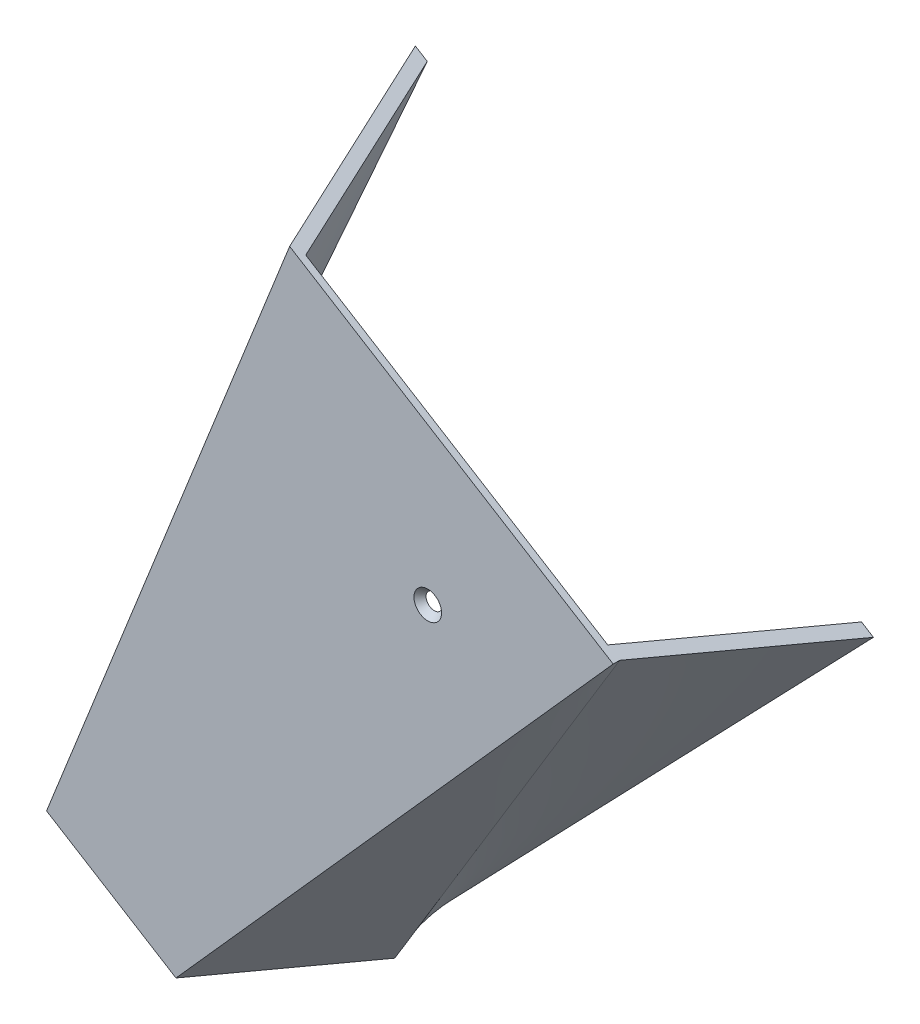
ISO-10303-21;
HEADER;
FILE_DESCRIPTION(('STEP AP214'),'2;1');
FILE_NAME('part.step','',(''),(''),'','','');
FILE_SCHEMA(('AUTOMOTIVE_DESIGN { 1 0 10303 214 1 1 1 1 }'));
ENDSEC;
DATA;
#1=APPLICATION_CONTEXT('core data for automotive mechanical design processes');
#2=APPLICATION_PROTOCOL_DEFINITION('international standard','automotive_design',2000,#1);
#3=PRODUCT_CONTEXT('',#1,'mechanical');
#4=PRODUCT('Part','Part','',(#3));
#5=PRODUCT_RELATED_PRODUCT_CATEGORY('part','',(#4));
#6=PRODUCT_DEFINITION_FORMATION('','',#4);
#7=PRODUCT_DEFINITION_CONTEXT('part definition',#1,'design');
#8=PRODUCT_DEFINITION('design','',#6,#7);
#9=PRODUCT_DEFINITION_SHAPE('','',#8);
#10=(LENGTH_UNIT() NAMED_UNIT(*) SI_UNIT(.MILLI.,.METRE.));
#11=(NAMED_UNIT(*) PLANE_ANGLE_UNIT() SI_UNIT($,.RADIAN.));
#12=(NAMED_UNIT(*) SI_UNIT($,.STERADIAN.) SOLID_ANGLE_UNIT());
#13=UNCERTAINTY_MEASURE_WITH_UNIT(LENGTH_MEASURE(1.E-05),#10,'distance_accuracy_value','');
#14=(GEOMETRIC_REPRESENTATION_CONTEXT(3) GLOBAL_UNCERTAINTY_ASSIGNED_CONTEXT((#13)) GLOBAL_UNIT_ASSIGNED_CONTEXT((#10,
#11,#12)) REPRESENTATION_CONTEXT('',''));
#15=CARTESIAN_POINT('',(0.,0.,0.));
#16=DIRECTION('',(0.,0.,1.));
#17=DIRECTION('',(1.,0.,0.));
#18=AXIS2_PLACEMENT_3D('',#15,#16,#17);
#19=CARTESIAN_POINT('',(149.802871080234,-23.3357740060547,1.));
#20=DIRECTION('',(-0.52566401508533,-0.850692272942672,0.));
#21=DIRECTION('',(0.850692272942672,-0.52566401508533,0.));
#22=AXIS2_PLACEMENT_3D('',#19,#20,#21);
#23=PLANE('',#22);
#24=DIRECTION('',(-0.850692272942672,0.52566401508533,0.));
#25=VECTOR('',#24,1.);
#26=CARTESIAN_POINT('',(149.802871080234,-23.3357740060547,0.));
#27=LINE('',#26,#25);
#28=CARTESIAN_POINT('',(147.96130571807,-22.1978247462492,0.));
#29=VERTEX_POINT('',#28);
#30=CARTESIAN_POINT('',(101.29206816554,6.64026344746749,0.));
#31=VERTEX_POINT('',#30);
#32=EDGE_CURVE('E157',#29,#31,#27,.T.);
#33=ORIENTED_EDGE('',*,*,#32,.T.);
#34=DIRECTION('',(-0.325545838896159,0.201162909563667,-0.923879532511288));
#35=VECTOR('',#34,1.);
#36=CARTESIAN_POINT('',(101.29206816554,6.64026344746748,0.));
#37=LINE('',#36,#35);
#38=CARTESIAN_POINT('',(91.0733881366334,12.9546412121627,-29.));
#39=VERTEX_POINT('',#38);
#40=EDGE_CURVE('E447',#31,#39,#37,.T.);
#41=ORIENTED_EDGE('',*,*,#40,.T.);
#42=DIRECTION('',(-0.850692272942673,0.525664015085329,0.));
#43=VECTOR('',#42,1.);
#44=CARTESIAN_POINT('',(91.0733881366334,12.9546412121627,-29.));
#45=LINE('',#44,#43);
#46=CARTESIAN_POINT('',(89.2318227744691,14.0925904719682,-29.));
#47=VERTEX_POINT('',#46);
#48=EDGE_CURVE('E433',#39,#47,#45,.T.);
#49=ORIENTED_EDGE('',*,*,#48,.T.);
#50=DIRECTION('',(0.32554583889616,-0.201162909563667,0.923879532511288));
#51=VECTOR('',#50,1.);
#52=CARTESIAN_POINT('',(89.2318227744691,14.0925904719682,-29.));
#53=LINE('',#52,#51);
#54=CARTESIAN_POINT('',(99.8028710802345,7.56047554297313,1.));
#55=VERTEX_POINT('',#54);
#56=EDGE_CURVE('E427',#47,#55,#53,.T.);
#57=ORIENTED_EDGE('',*,*,#56,.T.);
#58=DIRECTION('',(-0.850692272942672,0.52566401508533,0.));
#59=VECTOR('',#58,1.);
#60=CARTESIAN_POINT('',(149.802871080234,-23.3357740060547,1.));
#61=LINE('',#60,#59);
#62=CARTESIAN_POINT('',(149.802871080234,-23.3357740060547,1.));
#63=VERTEX_POINT('',#62);
#64=EDGE_CURVE('E156',#63,#55,#61,.T.);
#65=ORIENTED_EDGE('',*,*,#64,.F.);
#66=DIRECTION('',(0.,0.,1.));
#67=VECTOR('',#66,1.);
#68=CARTESIAN_POINT('',(149.802871080234,-23.3357740060547,1.));
#69=LINE('',#68,#67);
#70=CARTESIAN_POINT('',(149.802871080235,-23.3357740060547,0.));
#71=VERTEX_POINT('',#70);
#72=EDGE_CURVE('E106',#63,#71,#69,.F.);
#73=ORIENTED_EDGE('',*,*,#72,.T.);
#74=DIRECTION('',(-0.325545838896166,0.201162909563671,0.923879532511285));
#75=VECTOR('',#74,1.);
#76=CARTESIAN_POINT('',(160.021551109141,-29.6501517707501,-29.));
#77=LINE('',#76,#75);
#78=CARTESIAN_POINT('',(160.021551109141,-29.6501517707501,-29.));
#79=VERTEX_POINT('',#78);
#80=EDGE_CURVE('E282',#79,#71,#77,.T.);
#81=ORIENTED_EDGE('',*,*,#80,.F.);
#82=DIRECTION('',(0.850692272942672,-0.525664015085331,0.));
#83=VECTOR('',#82,1.);
#84=CARTESIAN_POINT('',(158.179985746977,-28.5122025109446,-29.));
#85=LINE('',#84,#83);
#86=CARTESIAN_POINT('',(158.179985746977,-28.5122025109446,-29.));
#87=VERTEX_POINT('',#86);
#88=EDGE_CURVE('E336',#87,#79,#85,.T.);
#89=ORIENTED_EDGE('',*,*,#88,.F.);
#90=DIRECTION('',(0.325545838896165,-0.20116290956367,-0.923879532511285));
#91=VECTOR('',#90,1.);
#92=CARTESIAN_POINT('',(147.608937441211,-21.9800875819494,1.));
#93=LINE('',#92,#91);
#94=EDGE_CURVE('E300',#29,#87,#93,.T.);
#95=ORIENTED_EDGE('',*,*,#94,.F.);
#96=EDGE_LOOP('',(#33,#41,#49,#57,#65,#73,#81,#89,#95));
#97=FACE_BOUND('',#96,.T.);
#98=ADVANCED_FACE('F65',(#97),#23,.F.);
#99=CARTESIAN_POINT('',(99.8028710802344,7.56047554297311,1.));
#100=DIRECTION('',(0.929048944106169,-0.369956834583728,0.));
#101=DIRECTION('',(0.369956834583728,0.929048944106169,0.));
#102=AXIS2_PLACEMENT_3D('',#99,#100,#101);
#103=PLANE('',#102);
#104=DIRECTION('',(-0.369956834583728,-0.929048944106169,0.));
#105=VECTOR('',#104,1.);
#106=CARTESIAN_POINT('',(99.8028710802344,7.56047554297311,1.));
#107=LINE('',#106,#105);
#108=CARTESIAN_POINT('',(62.2364695717015,-86.7776266160025,1.));
#109=VERTEX_POINT('',#108);
#110=EDGE_CURVE('E434',#55,#109,#107,.T.);
#111=ORIENTED_EDGE('',*,*,#110,.F.);
#112=CARTESIAN_POINT('',(99.8028710802345,7.56047554297313,0.999999999999995));
#113=CARTESIAN_POINT('',(97.800730805034,2.53262868424312,0.960822395884246));
#114=CARTESIAN_POINT('',(95.7985853509799,-2.49523117981043,0.923605511379088));
#115=CARTESIAN_POINT('',(91.794285743516,-12.5509727540539,0.852845594113708));
#116=CARTESIAN_POINT('',(89.7921315901069,-17.5788544642416,0.819302560992819));
#117=CARTESIAN_POINT('',(85.6605299173965,-27.9542815754014,0.753619185177171));
#118=CARTESIAN_POINT('',(83.531081910453,-33.3018282009582,0.721703588555466));
#119=CARTESIAN_POINT('',(79.2721788066195,-43.9969392566009,0.661483839307116));
#120=CARTESIAN_POINT('',(77.1427237097292,-49.3445036866878,0.633179686881937));
#121=CARTESIAN_POINT('',(72.8838046720515,-60.0396547559747,0.579939275846278));
#122=CARTESIAN_POINT('',(70.7543407312557,-65.3872413951956,0.555003022144702));
#123=CARTESIAN_POINT('',(66.4954083403662,-76.0824259975495,0.508281573717108));
#124=CARTESIAN_POINT('',(64.3659398902729,-81.4300239606813,0.486496378651858));
#125=CARTESIAN_POINT('',(62.2364695717015,-86.7776266160025,0.466178268526764));
#126=B_SPLINE_CURVE_WITH_KNOTS('',3,(#112,#113,#114,#115,#116,#117,#118,#119,#120,#121,#122,
#123,#124,#125),.UNSPECIFIED.,.F.,.F.,(4,2,2,2,2,2,4),(0.,16.2358886563819,32.4717757188637,
49.7398491256509,67.0079234957484,84.2760230347747,101.544120714778),.UNSPECIFIED.);
#127=CARTESIAN_POINT('',(62.2364695717015,-86.7776266160025,0.466178268526759));
#128=VERTEX_POINT('',#127);
#129=EDGE_CURVE('E410',#55,#128,#126,.T.);
#130=ORIENTED_EDGE('',*,*,#129,.T.);
#131=DIRECTION('',(0.,0.,-1.));
#132=VECTOR('',#131,1.);
#133=CARTESIAN_POINT('',(62.2364695717015,-86.7776266160025,1.));
#134=LINE('',#133,#132);
#135=EDGE_CURVE('E179',#109,#128,#134,.T.);
#136=ORIENTED_EDGE('',*,*,#135,.F.);
#137=EDGE_LOOP('',(#111,#130,#136));
#138=FACE_BOUND('',#137,.T.);
#139=ADVANCED_FACE('F357',(#138),#103,.F.);
#140=CARTESIAN_POINT('',(62.2364695717015,-86.7776266160025,1.));
#141=DIRECTION('',(0.52566401508533,0.850692272942672,0.));
#142=DIRECTION('',(-0.850692272942672,0.52566401508533,0.));
#143=AXIS2_PLACEMENT_3D('',#140,#141,#142);
#144=PLANE('',#143);
#145=ORIENTED_EDGE('',*,*,#135,.T.);
#146=DIRECTION('',(-0.421516202402935,0.260465395567993,-0.868609157690279));
#147=VECTOR('',#146,1.);
#148=CARTESIAN_POINT('',(62.4955210760732,-86.9377010145049,1.));
#149=LINE('',#148,#147);
#150=CARTESIAN_POINT('',(50.3635915807698,-79.4410785905428,-24.));
#151=VERTEX_POINT('',#150);
#152=EDGE_CURVE('E117',#128,#151,#149,.T.);
#153=ORIENTED_EDGE('',*,*,#152,.T.);
#154=DIRECTION('',(0.850692272942669,-0.525664015085336,0.));
#155=VECTOR('',#154,1.);
#156=CARTESIAN_POINT('',(50.3635915807698,-79.4410785905428,-24.));
#157=LINE('',#156,#155);
#158=CARTESIAN_POINT('',(52.3223373881587,-80.6514365759068,-24.));
#159=VERTEX_POINT('',#158);
#160=EDGE_CURVE('E400',#151,#159,#157,.T.);
#161=ORIENTED_EDGE('',*,*,#160,.T.);
#162=DIRECTION('',(0.421516202402931,-0.260465395567989,0.868609157690283));
#163=VECTOR('',#162,1.);
#164=CARTESIAN_POINT('',(52.3223373881587,-80.6514365759068,-24.));
#165=LINE('',#164,#163);
#166=CARTESIAN_POINT('',(58.7374315007476,-84.6154835475677,-10.7805568045206));
#167=VERTEX_POINT('',#166);
#168=EDGE_CURVE('E397',#159,#167,#165,.T.);
#169=ORIENTED_EDGE('',*,*,#168,.T.);
#170=DIRECTION('',(0.421516202402956,-0.260465395568005,0.868609157690266));
#171=VECTOR('',#170,1.);
#172=CARTESIAN_POINT('',(58.7374315007476,-84.6154835475677,-10.7805568045206));
#173=LINE('',#172,#171);
#174=CARTESIAN_POINT('',(63.9689897036503,-87.8481941029106,0.));
#175=VERTEX_POINT('',#174);
#176=EDGE_CURVE('E151',#167,#175,#173,.T.);
#177=ORIENTED_EDGE('',*,*,#176,.T.);
#178=DIRECTION('',(0.850692272942672,-0.52566401508533,0.));
#179=VECTOR('',#178,1.);
#180=CARTESIAN_POINT('',(62.2364695717015,-86.7776266160025,0.));
#181=LINE('',#180,#179);
#182=CARTESIAN_POINT('',(80.7472724863961,-98.215914340108,0.));
#183=VERTEX_POINT('',#182);
#184=EDGE_CURVE('E142',#175,#183,#181,.T.);
#185=ORIENTED_EDGE('',*,*,#184,.T.);
#186=DIRECTION('',(0.32554583889616,-0.201162909563667,-0.923879532511288));
#187=VECTOR('',#186,1.);
#188=CARTESIAN_POINT('',(80.3955101727458,-97.9985516156184,0.998280312819211));
#189=LINE('',#188,#187);
#190=CARTESIAN_POINT('',(89.2041111310084,-103.441606283304,-24.));
#191=VERTEX_POINT('',#190);
#192=EDGE_CURVE('E147',#183,#191,#189,.T.);
#193=ORIENTED_EDGE('',*,*,#192,.T.);
#194=DIRECTION('',(0.850692272942673,-0.525664015085328,0.));
#195=VECTOR('',#194,1.);
#196=CARTESIAN_POINT('',(89.2041111310084,-103.441606283304,-24.));
#197=LINE('',#196,#195);
#198=CARTESIAN_POINT('',(91.0456764931727,-104.57955554311,-24.));
#199=VERTEX_POINT('',#198);
#200=EDGE_CURVE('E168',#191,#199,#197,.T.);
#201=ORIENTED_EDGE('',*,*,#200,.T.);
#202=DIRECTION('',(-0.32554583889616,0.201162909563667,0.923879532511288));
#203=VECTOR('',#202,1.);
#204=CARTESIAN_POINT('',(91.0456764931727,-104.57955554311,-24.));
#205=LINE('',#204,#203);
#206=CARTESIAN_POINT('',(82.2364695717015,-99.1361264356136,1.));
#207=VERTEX_POINT('',#206);
#208=EDGE_CURVE('E307',#199,#207,#205,.T.);
#209=ORIENTED_EDGE('',*,*,#208,.T.);
#210=DIRECTION('',(0.850692272942672,-0.52566401508533,0.));
#211=VECTOR('',#210,1.);
#212=CARTESIAN_POINT('',(62.2364695717015,-86.7776266160025,1.));
#213=LINE('',#212,#211);
#214=EDGE_CURVE('E472',#109,#207,#213,.T.);
#215=ORIENTED_EDGE('',*,*,#214,.F.);
#216=EDGE_LOOP('',(#145,#153,#161,#169,#177,#185,#193,#201,#209,#215));
#217=FACE_BOUND('',#216,.T.);
#218=ADVANCED_FACE('F145',(#217),#144,.F.);
#219=CARTESIAN_POINT('',(0.,0.,1.));
#220=DIRECTION('',(0.,0.,1.));
#221=DIRECTION('',(1.,0.,0.));
#222=AXIS2_PLACEMENT_3D('',#219,#220,#221);
#223=PLANE('',#222);
#224=CARTESIAN_POINT('',(121.150579346114,-29.7579794074423,1.));
#225=DIRECTION('',(0.,0.,1.));
#226=DIRECTION('',(1.,0.,0.));
#227=AXIS2_PLACEMENT_3D('',#224,#225,#226);
#228=CIRCLE('',#227,2.1336);
#229=CARTESIAN_POINT('',(123.284179346114,-29.7579794074423,1.));
#230=VERTEX_POINT('',#229);
#231=EDGE_CURVE('E726',#230,#230,#228,.T.);
#232=ORIENTED_EDGE('',*,*,#231,.F.);
#233=EDGE_LOOP('',(#232));
#234=FACE_BOUND('',#233,.T.);
#235=ORIENTED_EDGE('',*,*,#214,.T.);
#236=DIRECTION('',(0.66539916048739,0.746487747536874,0.));
#237=VECTOR('',#236,1.);
#238=CARTESIAN_POINT('',(82.2364695717015,-99.1361264356136,1.));
#239=LINE('',#238,#237);
#240=EDGE_CURVE('E312',#207,#63,#239,.T.);
#241=ORIENTED_EDGE('',*,*,#240,.T.);
#242=ORIENTED_EDGE('',*,*,#64,.T.);
#243=ORIENTED_EDGE('',*,*,#110,.T.);
#244=EDGE_LOOP('',(#235,#241,#242,#243));
#245=FACE_BOUND('',#244,.T.);
#246=ADVANCED_FACE('F356',(#234,#245),#223,.T.);
#247=CARTESIAN_POINT('',(0.,0.,0.));
#248=DIRECTION('',(0.,0.,1.));
#249=DIRECTION('',(1.,0.,0.));
#250=AXIS2_PLACEMENT_3D('',#247,#248,#249);
#251=PLANE('',#250);
#252=CARTESIAN_POINT('',(121.150579346114,-29.7579794074423,0.));
#253=DIRECTION('',(0.,0.,1.));
#254=DIRECTION('',(1.,0.,0.));
#255=AXIS2_PLACEMENT_3D('',#252,#253,#254);
#256=CIRCLE('',#255,1.26431326218377);
#257=CARTESIAN_POINT('',(122.414892608298,-29.7579794074423,0.));
#258=VERTEX_POINT('',#257);
#259=EDGE_CURVE('E69',#258,#258,#256,.T.);
#260=ORIENTED_EDGE('',*,*,#259,.T.);
#261=EDGE_LOOP('',(#260));
#262=FACE_BOUND('',#261,.T.);
#263=ORIENTED_EDGE('',*,*,#184,.F.);
#264=CARTESIAN_POINT('',(63.9689897036503,-87.8481941029106,0.));
#265=CARTESIAN_POINT('',(65.6086194750051,-83.6351551124729,0.));
#266=CARTESIAN_POINT('',(67.2484328201354,-79.4221874808441,0.));
#267=CARTESIAN_POINT('',(70.5287858793149,-70.9965332574647,0.));
#268=CARTESIAN_POINT('',(72.1693255936286,-66.7838466658172,0.));
#269=CARTESIAN_POINT('',(75.4514894498988,-58.3588958337148,0.));
#270=CARTESIAN_POINT('',(77.0931135918764,-54.1466315932682,0.));
#271=CARTESIAN_POINT('',(80.3781688825248,-45.7228086014839,0.));
#272=CARTESIAN_POINT('',(82.0216000307855,-41.5112498499864,0.));
#273=CARTESIAN_POINT('',(84.4893524719697,-35.1949294805937,0.));
#274=CARTESIAN_POINT('',(85.3123709224591,-33.0896589404609,0.));
#275=CARTESIAN_POINT('',(86.9597074837296,-28.8796254856154,0.));
#276=CARTESIAN_POINT('',(87.7840255949692,-26.7748625710821,0.));
#277=CARTESIAN_POINT('',(89.4346382151987,-22.566108322076,0.));
#278=CARTESIAN_POINT('',(90.2609327266165,-20.4621169885545,0.));
#279=CARTESIAN_POINT('',(91.5028678425473,-17.3071116524831,0.));
#280=CARTESIAN_POINT('',(91.9172617096508,-16.2556069771521,0.));
#281=CARTESIAN_POINT('',(92.7471784845071,-14.1530433633892,0.));
#282=CARTESIAN_POINT('',(93.162701392066,-13.101984424881,0.));
#283=CARTESIAN_POINT('',(93.9953000494071,-11.0004790612977,0.));
#284=CARTESIAN_POINT('',(94.4123758021574,-9.95003263739797,0.));
#285=CARTESIAN_POINT('',(95.2487592351119,-7.85002972264891,0.));
#286=CARTESIAN_POINT('',(95.6680669128099,-6.80047323080186,0.));
#287=CARTESIAN_POINT('',(96.5061667403792,-4.71230883889109,0.));
#288=CARTESIAN_POINT('',(96.9249284128549,-3.67368873346316,0.));
#289=CARTESIAN_POINT('',(97.5570654094205,-2.11737578436286,0.));
#290=CARTESIAN_POINT('',(97.7684442959385,-1.59887237978736,0.));
#291=CARTESIAN_POINT('',(98.1929666617397,-0.562588531000391,0.));
#292=CARTESIAN_POINT('',(98.4061101384246,-0.0448080857257373,0.));
#293=CARTESIAN_POINT('',(98.8348197251901,0.989906302302367,0.));
#294=CARTESIAN_POINT('',(99.0503864463049,1.50683999210468,0.));
#295=CARTESIAN_POINT('',(99.4847936752876,2.53931743426768,0.));
#296=CARTESIAN_POINT('',(99.7036340915436,3.05486122504893,0.));
#297=CARTESIAN_POINT('',(100.0355090532,3.82672178932578,0.));
#298=CARTESIAN_POINT('',(100.146754651827,4.08380744310608,0.));
#299=CARTESIAN_POINT('',(100.370724552992,4.59733171023877,0.));
#300=CARTESIAN_POINT('',(100.483448842657,4.85377032920023,0.));
#301=CARTESIAN_POINT('',(100.710734352953,5.36586056859856,0.));
#302=CARTESIAN_POINT('',(100.825295729835,5.6215121198642,0.));
#303=CARTESIAN_POINT('',(101.056779463549,6.13175231002322,0.));
#304=CARTESIAN_POINT('',(101.173701890939,6.38634091687614,0.));
#305=CARTESIAN_POINT('',(101.29206816554,6.64026344746748,0.));
#306=B_SPLINE_CURVE_WITH_KNOTS('',3,(#264,#265,#266,#267,#268,#269,#270,#271,#272,#273,#274,
#275,#276,#277,#278,#279,#280,#281,#282,#283,#284,#285,#286,#287,#288,#289,#290,#291,#292,#293,
#294,#295,#296,#297,#298,#299,#300,#301,#302,#303,#304,#305),.UNSPECIFIED.,.F.,.F.,(4,2,2,2,2,2,
2,2,2,2,2,2,2,2,2,2,2,2,2,2,4),(0.,13.5625496592338,27.1251042627583,40.6876591332418,
54.2502109270663,61.0314871030628,67.812765672113,74.5940525756081,77.9846949993739,
81.3753368408808,84.7659851666527,88.1566296859162,91.5162076848358,93.1960093803738,
94.8758086030077,96.55604134649,98.2362271575374,99.0765910039275,99.9169475400858,
100.757375935066,101.59782948289),.UNSPECIFIED.);
#307=EDGE_CURVE('E12',#175,#31,#306,.T.);
#308=ORIENTED_EDGE('',*,*,#307,.T.);
#309=ORIENTED_EDGE('',*,*,#32,.F.);
#310=CARTESIAN_POINT('',(147.96130571807,-22.1978247462492,0.));
#311=CARTESIAN_POINT('',(140.791668954574,-30.3066838648569,0.));
#312=CARTESIAN_POINT('',(133.622035574568,-38.4155459750087,0.));
#313=CARTESIAN_POINT('',(119.207749279571,-54.718107634288,0.));
#314=CARTESIAN_POINT('',(111.963096314083,-62.9118071387679,0.));
#315=CARTESIAN_POINT('',(101.096104237844,-75.2023452303936,0.));
#316=CARTESIAN_POINT('',(97.4737714410523,-79.2991894001369,0.));
#317=CARTESIAN_POINT('',(92.040250115751,-85.4444360881807,0.));
#318=CARTESIAN_POINT('',(90.2290726521707,-87.4928483899112,0.));
#319=CARTESIAN_POINT('',(87.5122769885335,-90.5654407881803,0.));
#320=CARTESIAN_POINT('',(86.6066735223356,-91.5896339121925,0.));
#321=CARTESIAN_POINT('',(85.2482370044789,-93.1258959067707,0.));
#322=CARTESIAN_POINT('',(84.7954196117179,-93.6379786234888,0.));
#323=CARTESIAN_POINT('',(84.1161721982735,-94.4060838429654,0.));
#324=CARTESIAN_POINT('',(83.8897528394332,-94.6621157738728,0.));
#325=CARTESIAN_POINT('',(83.4368982754944,-95.1741656225817,0.));
#326=CARTESIAN_POINT('',(83.2104630703959,-95.4301835403832,0.));
#327=CARTESIAN_POINT('',(82.9840155736884,-95.6861905870018,0.));
#328=B_SPLINE_CURVE_WITH_KNOTS('',3,(#310,#311,#312,#313,#314,#315,#316,#317,#318,#319,#320,
#321,#322,#323,#324,#325,#326,#327),.UNSPECIFIED.,.F.,.F.,(4,2,2,2,2,2,2,2,4),(0.,
32.4717660087722,65.2832788273424,81.6890352370311,89.8919134430315,93.9933525485168,
96.0440721047197,97.0694318856136,98.0947916696842),.UNSPECIFIED.);
#329=CARTESIAN_POINT('',(82.9840155736884,-95.6861905870018,0.));
#330=VERTEX_POINT('',#329);
#331=EDGE_CURVE('E175',#29,#330,#328,.T.);
#332=ORIENTED_EDGE('',*,*,#331,.T.);
#333=CARTESIAN_POINT('',(82.9840155736884,-95.6861905870018,0.));
#334=CARTESIAN_POINT('',(82.6115850377633,-96.1081295001179,0.));
#335=CARTESIAN_POINT('',(82.2389745125263,-96.5299092694347,0.));
#336=CARTESIAN_POINT('',(81.4933934834289,-97.3731505204701,0.));
#337=CARTESIAN_POINT('',(81.1204229795684,-97.7946120021886,0.));
#338=CARTESIAN_POINT('',(80.7472724863961,-98.215914340108,0.));
#339=B_SPLINE_CURVE_WITH_KNOTS('',3,(#333,#334,#335,#336,#337,#338),.UNSPECIFIED.,.F.,.F.,(4,2,
4),(0.,1.68838117612731,3.37676235225463),.UNSPECIFIED.);
#340=EDGE_CURVE('E75',#330,#183,#339,.T.);
#341=ORIENTED_EDGE('',*,*,#340,.T.);
#342=EDGE_LOOP('',(#263,#308,#309,#332,#341));
#343=FACE_BOUND('',#342,.T.);
#344=ADVANCED_FACE('F173',(#262,#343),#251,.F.);
#345=CARTESIAN_POINT('',(158.179985746977,-28.5122025109446,-29.));
#346=CARTESIAN_POINT('',(80.3955101727458,-97.9985516156184,0.998280312819211));
#347=CARTESIAN_POINT('',(158.486913307338,-28.7018607209123,-29.));
#348=CARTESIAN_POINT('',(81.8636103324563,-98.905727393566,-3.16809973931728));
#349=CARTESIAN_POINT('',(158.793840867699,-28.8915189308799,-29.));
#350=CARTESIAN_POINT('',(83.3317104921667,-99.8129031715136,-7.33447979145379));
#351=CARTESIAN_POINT('',(159.40769598842,-29.270835350815,-29.));
#352=CARTESIAN_POINT('',(86.2679108115875,-101.627254727409,-15.6672398957269));
#353=CARTESIAN_POINT('',(159.714623548781,-29.4604935607826,-29.));
#354=CARTESIAN_POINT('',(87.736010971298,-102.534430505356,-19.8336199478634));
#355=CARTESIAN_POINT('',(160.021551109141,-29.6501517707501,-29.));
#356=CARTESIAN_POINT('',(89.2041111310084,-103.441606283304,-24.));
#357=B_SPLINE_SURFACE_WITH_KNOTS('',3,1,((#345,#346),(#347,#348),(#349,#350),(#351,#352),(#353,
#354),(#355,#356)),.UNSPECIFIED.,.F.,.F.,.F.,(4,2,4),(2,2),(0.,0.5,1.),(0.,1.),.UNSPECIFIED.);
#358=DIRECTION('',(-0.716712079020224,-0.640252510063002,0.276406438319612));
#359=VECTOR('',#358,1.);
#360=CARTESIAN_POINT('',(119.287747959861,-63.2553770632815,-14.0008598435904));
#361=LINE('',#360,#359);
#362=EDGE_CURVE('E92',#87,#330,#361,.T.);
#363=DIRECTION('',(0.691592109323064,0.720635872916506,-0.0488292226841732));
#364=VECTOR('',#363,1.);
#365=CARTESIAN_POINT('',(124.612831120075,-66.5458790270271,-26.5));
#366=LINE('',#365,#364);
#367=EDGE_CURVE('E166',#191,#79,#366,.T.);
#368=ORIENTED_EDGE('',*,*,#340,.F.);
#369=ORIENTED_EDGE('',*,*,#362,.F.);
#370=ORIENTED_EDGE('',*,*,#88,.T.);
#371=ORIENTED_EDGE('',*,*,#367,.F.);
#372=ORIENTED_EDGE('',*,*,#192,.F.);
#373=EDGE_LOOP('',(#368,#369,#370,#371,#372));
#374=FACE_BOUND('',#373,.T.);
#375=ADVANCED_FACE('F162',(#374),#357,.T.);
#376=CARTESIAN_POINT('',(147.608937441211,-21.9800875819494,1.));
#377=CARTESIAN_POINT('',(80.3955101727458,-97.9985516156184,1.));
#378=CARTESIAN_POINT('',(149.370778825506,-23.0687734034486,-3.99999999999996));
#379=CARTESIAN_POINT('',(80.3955101727458,-97.9985516156184,0.999719659644229));
#380=CARTESIAN_POINT('',(151.1326202098,-24.1574592249478,-8.99999999999994));
#381=CARTESIAN_POINT('',(80.3955101727458,-97.9985516156184,0.999436182201279));
#382=CARTESIAN_POINT('',(154.656302978388,-26.3348308679462,-18.9999999999999));
#383=CARTESIAN_POINT('',(80.3955101727458,-97.9985516156184,0.998862953141016));
#384=CARTESIAN_POINT('',(156.418144362683,-27.4235166894454,-24.));
#385=CARTESIAN_POINT('',(80.3955101727458,-97.9985516156184,0.998573201523704));
#386=CARTESIAN_POINT('',(158.179985746977,-28.5122025109446,-29.));
#387=CARTESIAN_POINT('',(80.3955101727458,-97.9985516156184,0.998280312819211));
#388=B_SPLINE_SURFACE_WITH_KNOTS('',3,1,((#376,#377),(#378,#379),(#380,#381),(#382,#383),(#384,
#385),(#386,#387)),.UNSPECIFIED.,.F.,.F.,.F.,(4,2,4),(2,2),(0.,0.5,1.),(0.,1.),.UNSPECIFIED.);
#389=ORIENTED_EDGE('',*,*,#331,.F.);
#390=ORIENTED_EDGE('',*,*,#94,.T.);
#391=ORIENTED_EDGE('',*,*,#362,.T.);
#392=EDGE_LOOP('',(#389,#390,#391));
#393=FACE_BOUND('',#392,.T.);
#394=ADVANCED_FACE('F206',(#393),#388,.T.);
#395=CARTESIAN_POINT('',(160.021551109141,-29.6501517707501,-29.));
#396=CARTESIAN_POINT('',(89.2041111310084,-103.441606283304,-24.));
#397=CARTESIAN_POINT('',(158.31843777099,-28.5977554766342,-24.1666666666667));
#398=CARTESIAN_POINT('',(89.5110386913691,-103.631264493272,-24.));
#399=CARTESIAN_POINT('',(156.615324432839,-27.5453591825183,-19.3333333333334));
#400=CARTESIAN_POINT('',(89.8179662517298,-103.820922703239,-24.));
#401=CARTESIAN_POINT('',(153.209097756537,-25.4405665942865,-9.66666666666669));
#402=CARTESIAN_POINT('',(90.4318213724512,-104.200239123174,-24.));
#403=CARTESIAN_POINT('',(151.505984418386,-24.3881703001706,-4.83333333333336));
#404=CARTESIAN_POINT('',(90.738748932812,-104.389897333142,-24.));
#405=CARTESIAN_POINT('',(149.802871080235,-23.3357740060547,0.));
#406=CARTESIAN_POINT('',(91.0456764931727,-104.57955554311,-24.));
#407=B_SPLINE_SURFACE_WITH_KNOTS('',3,1,((#395,#396),(#397,#398),(#399,#400),(#401,#402),(#403,
#404),(#405,#406)),.UNSPECIFIED.,.F.,.F.,.F.,(4,2,4),(2,2),(0.,0.5,1.),(0.,1.),.UNSPECIFIED.);
#408=DIRECTION('',(-0.569922321004129,-0.788033616413443,-0.232790823323464));
#409=VECTOR('',#408,1.);
#410=CARTESIAN_POINT('',(120.424273786704,-63.9576647745821,-12.));
#411=LINE('',#410,#409);
#412=EDGE_CURVE('E281',#71,#199,#411,.T.);
#413=ORIENTED_EDGE('',*,*,#80,.T.);
#414=ORIENTED_EDGE('',*,*,#412,.T.);
#415=ORIENTED_EDGE('',*,*,#200,.F.);
#416=ORIENTED_EDGE('',*,*,#367,.T.);
#417=EDGE_LOOP('',(#413,#414,#415,#416));
#418=FACE_BOUND('',#417,.T.);
#419=ADVANCED_FACE('F245',(#418),#407,.T.);
#420=CARTESIAN_POINT('',(149.802871080235,-23.3357740060547,0.));
#421=CARTESIAN_POINT('',(91.0456764931727,-104.57955554311,-24.));
#422=CARTESIAN_POINT('',(149.802871080234,-23.3357740060547,0.166666666666665));
#423=CARTESIAN_POINT('',(89.5774753395941,-103.672317358527,-19.8333333333333));
#424=CARTESIAN_POINT('',(149.802871080234,-23.3357740060547,0.333333333333332));
#425=CARTESIAN_POINT('',(88.1092741860156,-102.765079173944,-15.6666666666667));
#426=CARTESIAN_POINT('',(149.802871080234,-23.3357740060547,0.666666666666666));
#427=CARTESIAN_POINT('',(85.1728718788586,-100.950602804779,-7.33333333333333));
#428=CARTESIAN_POINT('',(149.802871080234,-23.3357740060547,0.833333333333333));
#429=CARTESIAN_POINT('',(83.70467072528,-100.043364620196,-3.16666666666666));
#430=CARTESIAN_POINT('',(149.802871080235,-23.3357740060547,1.));
#431=CARTESIAN_POINT('',(82.2364695717015,-99.1361264356136,1.));
#432=B_SPLINE_SURFACE_WITH_KNOTS('',3,1,((#420,#421),(#422,#423),(#424,#425),(#426,#427),(#428,
#429),(#430,#431)),.UNSPECIFIED.,.F.,.F.,.F.,(4,2,4),(2,2),(0.,0.5,1.),(0.,1.),.UNSPECIFIED.);
#433=ORIENTED_EDGE('',*,*,#72,.F.);
#434=ORIENTED_EDGE('',*,*,#240,.F.);
#435=ORIENTED_EDGE('',*,*,#208,.F.);
#436=ORIENTED_EDGE('',*,*,#412,.F.);
#437=EDGE_LOOP('',(#433,#434,#435,#436));
#438=FACE_BOUND('',#437,.T.);
#439=ADVANCED_FACE('F207',(#438),#432,.T.);
#440=CARTESIAN_POINT('',(99.8028710802345,7.56047554297313,0.99999999999999));
#441=CARTESIAN_POINT('',(62.4955210760732,-86.9377010145049,1.));
#442=CARTESIAN_POINT('',(98.0410296959402,8.64916136447231,-3.99999999999999));
#443=CARTESIAN_POINT('',(60.473532826856,-85.6882639438445,-3.16666666666665));
#444=CARTESIAN_POINT('',(96.279188311646,9.7378471859715,-8.99999999999999));
#445=CARTESIAN_POINT('',(58.4515445776388,-84.4388268731842,-7.33333333333331));
#446=CARTESIAN_POINT('',(92.7555055430575,11.9152188289699,-19.));
#447=CARTESIAN_POINT('',(54.4075680792043,-81.9399527318635,-15.6666666666666));
#448=CARTESIAN_POINT('',(90.9936641587633,13.0039046504691,-24.));
#449=CARTESIAN_POINT('',(52.385579829987,-80.6905156612031,-19.8333333333333));
#450=CARTESIAN_POINT('',(89.2318227744691,14.0925904719682,-29.));
#451=CARTESIAN_POINT('',(50.3635915807698,-79.4410785905428,-24.));
#452=B_SPLINE_SURFACE_WITH_KNOTS('',3,1,((#440,#441),(#442,#443),(#444,#445),(#446,#447),(#448,
#449),(#450,#451)),.UNSPECIFIED.,.F.,.F.,.F.,(4,2,4),(2,2),(0.,0.5,1.),(0.,1.),.UNSPECIFIED.);
#453=DIRECTION('',(-0.383272527690945,-0.922318424708973,0.0493040866435253));
#454=VECTOR('',#453,1.);
#455=CARTESIAN_POINT('',(69.7977071776194,-32.6742440592873,-26.5));
#456=LINE('',#455,#454);
#457=EDGE_CURVE('E425',#47,#151,#456,.T.);
#458=ORIENTED_EDGE('',*,*,#129,.F.);
#459=ORIENTED_EDGE('',*,*,#56,.F.);
#460=ORIENTED_EDGE('',*,*,#457,.T.);
#461=ORIENTED_EDGE('',*,*,#152,.F.);
#462=EDGE_LOOP('',(#458,#459,#460,#461));
#463=FACE_BOUND('',#462,.T.);
#464=ADVANCED_FACE('F256',(#463),#452,.T.);
#465=CARTESIAN_POINT('',(101.29206816554,6.64026344746748,0.));
#466=CARTESIAN_POINT('',(58.7374315007476,-84.6154835475677,-10.7805568045206));
#467=CARTESIAN_POINT('',(101.29206816554,6.64026344746748,0.16666666666666));
#468=CARTESIAN_POINT('',(59.6902373978668,-85.2042461229513,-8.81713067043385));
#469=CARTESIAN_POINT('',(101.29206816554,6.64026344746748,0.333333333333328));
#470=CARTESIAN_POINT('',(60.6430432949859,-85.7930086983348,-6.85370453634709));
#471=CARTESIAN_POINT('',(101.29206816554,6.64026344746748,0.666666666666664));
#472=CARTESIAN_POINT('',(62.5486550892242,-86.9705338491019,-2.92685226817355));
#473=CARTESIAN_POINT('',(101.29206816554,6.64026344746748,0.833333333333332));
#474=CARTESIAN_POINT('',(63.5014609863433,-87.5592964244855,-0.963426134086776));
#475=CARTESIAN_POINT('',(101.29206816554,6.64026344746748,1.));
#476=CARTESIAN_POINT('',(64.4542668834625,-88.1480589998691,0.999999999999999));
#477=B_SPLINE_SURFACE_WITH_KNOTS('',3,1,((#465,#466),(#467,#468),(#469,#470),(#471,#472),(#473,
#474),(#475,#476)),.UNSPECIFIED.,.F.,.F.,.F.,(4,2,4),(2,2),(0.,0.5,1.),(0.,1.),.UNSPECIFIED.);
#478=DIRECTION('',(-0.420227815620832,-0.901152171140458,-0.106458195679723));
#479=VECTOR('',#478,1.);
#480=CARTESIAN_POINT('',(80.0147498331438,-38.9876100500501,-5.39027840226031));
#481=LINE('',#480,#479);
#482=EDGE_CURVE('E83',#31,#167,#481,.T.);
#483=ORIENTED_EDGE('',*,*,#307,.F.);
#484=ORIENTED_EDGE('',*,*,#176,.F.);
#485=ORIENTED_EDGE('',*,*,#482,.F.);
#486=EDGE_LOOP('',(#483,#484,#485));
#487=FACE_BOUND('',#486,.T.);
#488=ADVANCED_FACE('F507',(#487),#477,.T.);
#489=CARTESIAN_POINT('',(91.0733881366334,12.9546412121627,-29.));
#490=CARTESIAN_POINT('',(52.3223373881587,-80.6514365759068,-24.));
#491=CARTESIAN_POINT('',(92.7765014747845,11.9022449180469,-24.1666666666667));
#492=CARTESIAN_POINT('',(53.3915197402569,-81.3121110711836,-21.7967594674201));
#493=CARTESIAN_POINT('',(94.4796148129356,10.849848623931,-19.3333333333333));
#494=CARTESIAN_POINT('',(54.460702092355,-81.9727855664604,-19.5935189348402));
#495=CARTESIAN_POINT('',(97.8858414892377,8.74505603569924,-9.66666666666668));
#496=CARTESIAN_POINT('',(56.5990667965513,-83.2941345570141,-15.1870378696804));
#497=CARTESIAN_POINT('',(99.5889548273888,7.69265974158336,-4.83333333333335));
#498=CARTESIAN_POINT('',(57.6682491486495,-83.9548090522909,-12.9837973371005));
#499=CARTESIAN_POINT('',(101.29206816554,6.64026344746748,0.));
#500=CARTESIAN_POINT('',(58.7374315007476,-84.6154835475677,-10.7805568045206));
#501=B_SPLINE_SURFACE_WITH_KNOTS('',3,1,((#489,#490),(#491,#492),(#493,#494),(#495,#496),(#497,
#498),(#499,#500)),.UNSPECIFIED.,.F.,.F.,.F.,(4,2,4),(2,2),(0.,0.5,1.),(0.,1.),.UNSPECIFIED.);
#502=DIRECTION('',(0.382034294253939,0.922832572921963,-0.0492934110011166));
#503=VECTOR('',#502,1.);
#504=CARTESIAN_POINT('',(71.6978627623961,-33.848397681872,-26.5));
#505=LINE('',#504,#503);
#506=EDGE_CURVE('E432',#159,#39,#505,.T.);
#507=ORIENTED_EDGE('',*,*,#40,.F.);
#508=ORIENTED_EDGE('',*,*,#482,.T.);
#509=ORIENTED_EDGE('',*,*,#168,.F.);
#510=ORIENTED_EDGE('',*,*,#506,.T.);
#511=EDGE_LOOP('',(#507,#508,#509,#510));
#512=FACE_BOUND('',#511,.T.);
#513=ADVANCED_FACE('F583',(#512),#501,.T.);
#514=CARTESIAN_POINT('',(-0.683108362944718,-1.10548751533858,-25.9903034387402));
#515=DIRECTION('',(0.0262504082265199,0.04248154486334,0.998752338877845));
#516=DIRECTION('',(0.,-0.999096628916029,0.0424961891070967));
#517=AXIS2_PLACEMENT_3D('',#514,#515,#516);
#518=PLANE('',#517);
#519=ORIENTED_EDGE('',*,*,#506,.F.);
#520=ORIENTED_EDGE('',*,*,#160,.F.);
#521=ORIENTED_EDGE('',*,*,#457,.F.);
#522=ORIENTED_EDGE('',*,*,#48,.F.);
#523=EDGE_LOOP('',(#519,#520,#521,#522));
#524=FACE_BOUND('',#523,.T.);
#525=ADVANCED_FACE('F592',(#524),#518,.F.);
#526=CARTESIAN_POINT('',(121.150579346114,-29.7579794074423,1.));
#527=DIRECTION('',(0.,0.,1.));
#528=DIRECTION('',(1.,0.,0.));
#529=AXIS2_PLACEMENT_3D('',#526,#527,#528);
#530=CONICAL_SURFACE('',#529,2.1336,0.715584993317677);
#531=ORIENTED_EDGE('',*,*,#231,.T.);
#532=EDGE_LOOP('',(#531));
#533=FACE_BOUND('',#532,.T.);
#534=ORIENTED_EDGE('',*,*,#259,.F.);
#535=EDGE_LOOP('',(#534));
#536=FACE_BOUND('',#535,.T.);
#537=ADVANCED_FACE('F600',(#533,#536),#530,.F.);
#538=CLOSED_SHELL('',(#98,#139,#218,#246,#344,#375,#394,#419,#439,#464,#488,#513,#525,#537));
#539=MANIFOLD_SOLID_BREP('B2',#538);
#540=ADVANCED_BREP_SHAPE_REPRESENTATION('',(#18,#539),#14);
#541=SHAPE_DEFINITION_REPRESENTATION(#9,#540);
ENDSEC;
END-ISO-10303-21;
